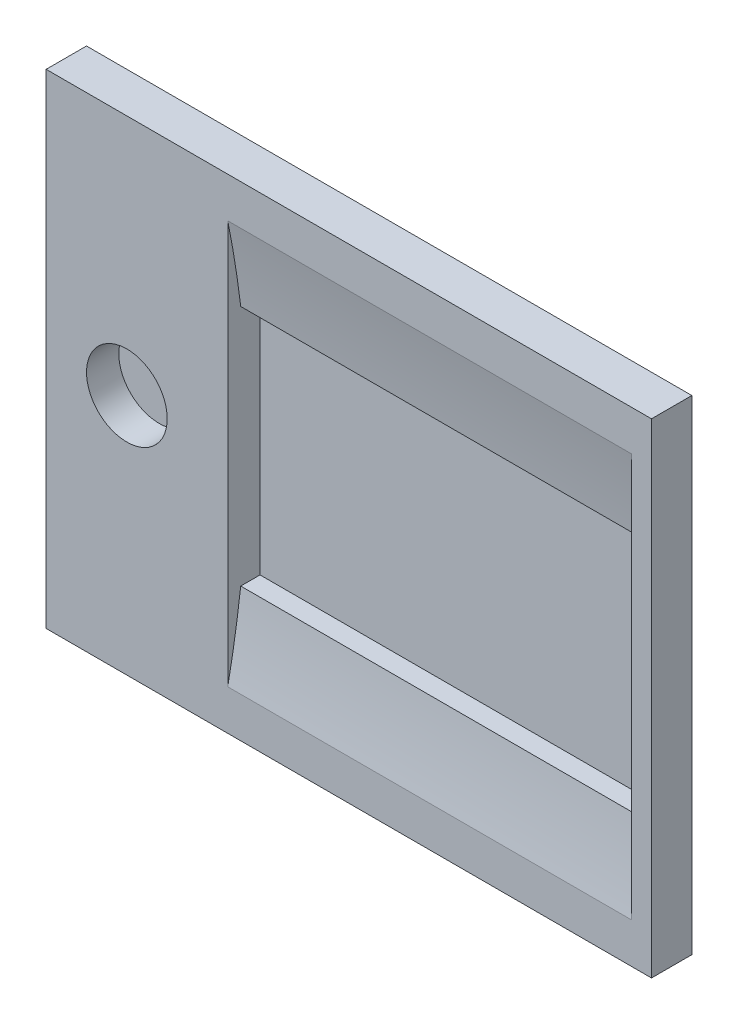
ISO-10303-21;
HEADER;
FILE_DESCRIPTION(('STEP AP214'),'2;1');
FILE_NAME('part.step','',(''),(''),'','','');
FILE_SCHEMA(('AUTOMOTIVE_DESIGN { 1 0 10303 214 1 1 1 1 }'));
ENDSEC;
DATA;
#1=APPLICATION_CONTEXT('core data for automotive mechanical design processes');
#2=APPLICATION_PROTOCOL_DEFINITION('international standard','automotive_design',2000,#1);
#3=PRODUCT_CONTEXT('',#1,'mechanical');
#4=PRODUCT('Part','Part','',(#3));
#5=PRODUCT_RELATED_PRODUCT_CATEGORY('part','',(#4));
#6=PRODUCT_DEFINITION_FORMATION('','',#4);
#7=PRODUCT_DEFINITION_CONTEXT('part definition',#1,'design');
#8=PRODUCT_DEFINITION('design','',#6,#7);
#9=PRODUCT_DEFINITION_SHAPE('','',#8);
#10=(LENGTH_UNIT() NAMED_UNIT(*) SI_UNIT(.MILLI.,.METRE.));
#11=(NAMED_UNIT(*) PLANE_ANGLE_UNIT() SI_UNIT($,.RADIAN.));
#12=(NAMED_UNIT(*) SI_UNIT($,.STERADIAN.) SOLID_ANGLE_UNIT());
#13=UNCERTAINTY_MEASURE_WITH_UNIT(LENGTH_MEASURE(1.E-05),#10,'distance_accuracy_value','');
#14=(GEOMETRIC_REPRESENTATION_CONTEXT(3) GLOBAL_UNCERTAINTY_ASSIGNED_CONTEXT((#13)) GLOBAL_UNIT_ASSIGNED_CONTEXT((#10,
#11,#12)) REPRESENTATION_CONTEXT('',''));
#15=CARTESIAN_POINT('',(0.,0.,0.));
#16=DIRECTION('',(0.,0.,1.));
#17=DIRECTION('',(1.,0.,0.));
#18=AXIS2_PLACEMENT_3D('',#15,#16,#17);
#19=CARTESIAN_POINT('',(0.,0.,1.5875));
#20=DIRECTION('',(0.,0.,-1.));
#21=DIRECTION('',(-1.,0.,0.));
#22=AXIS2_PLACEMENT_3D('',#19,#20,#21);
#23=PLANE('',#22);
#24=DIRECTION('',(0.,1.,0.));
#25=VECTOR('',#24,1.);
#26=CARTESIAN_POINT('',(23.8125,-19.05,1.5875));
#27=LINE('',#26,#25);
#28=CARTESIAN_POINT('',(23.8125,-19.05,1.5875));
#29=VERTEX_POINT('',#28);
#30=CARTESIAN_POINT('',(23.8125,19.05,1.5875));
#31=VERTEX_POINT('',#30);
#32=EDGE_CURVE('E179',#29,#31,#27,.T.);
#33=ORIENTED_EDGE('',*,*,#32,.T.);
#34=DIRECTION('',(-1.,0.,0.));
#35=VECTOR('',#34,1.);
#36=CARTESIAN_POINT('',(-23.8125,19.05,1.5875));
#37=LINE('',#36,#35);
#38=CARTESIAN_POINT('',(-23.8125,19.05,1.5875));
#39=VERTEX_POINT('',#38);
#40=EDGE_CURVE('E86',#31,#39,#37,.T.);
#41=ORIENTED_EDGE('',*,*,#40,.T.);
#42=DIRECTION('',(0.,-1.,0.));
#43=VECTOR('',#42,1.);
#44=CARTESIAN_POINT('',(-23.8125,-19.05,1.5875));
#45=LINE('',#44,#43);
#46=CARTESIAN_POINT('',(-23.8125,-19.05,1.5875));
#47=VERTEX_POINT('',#46);
#48=EDGE_CURVE('E182',#39,#47,#45,.T.);
#49=ORIENTED_EDGE('',*,*,#48,.T.);
#50=DIRECTION('',(1.,0.,0.));
#51=VECTOR('',#50,1.);
#52=CARTESIAN_POINT('',(-23.8125,-19.05,1.5875));
#53=LINE('',#52,#51);
#54=EDGE_CURVE('E58',#47,#29,#53,.T.);
#55=ORIENTED_EDGE('',*,*,#54,.T.);
#56=EDGE_LOOP('',(#33,#41,#49,#55));
#57=FACE_BOUND('',#56,.T.);
#58=CARTESIAN_POINT('',(-17.4625,0.,1.5875));
#59=DIRECTION('',(0.,0.,1.));
#60=DIRECTION('',(1.,0.,0.));
#61=AXIS2_PLACEMENT_3D('',#58,#59,#60);
#62=CIRCLE('',#61,3.175);
#63=CARTESIAN_POINT('',(-14.2875,0.,1.5875));
#64=VERTEX_POINT('',#63);
#65=EDGE_CURVE('E152',#64,#64,#62,.T.);
#66=ORIENTED_EDGE('',*,*,#65,.F.);
#67=EDGE_LOOP('',(#66));
#68=FACE_BOUND('',#67,.T.);
#69=DIRECTION('',(1.,0.,0.));
#70=VECTOR('',#69,1.);
#71=CARTESIAN_POINT('',(-41.3146627262701,15.875,1.5875));
#72=LINE('',#71,#70);
#73=CARTESIAN_POINT('',(-9.525,15.875,1.5875));
#74=VERTEX_POINT('',#73);
#75=CARTESIAN_POINT('',(22.225,15.875,1.5875));
#76=VERTEX_POINT('',#75);
#77=EDGE_CURVE('E138',#74,#76,#72,.T.);
#78=ORIENTED_EDGE('',*,*,#77,.T.);
#79=DIRECTION('',(0.,1.,0.));
#80=VECTOR('',#79,1.);
#81=CARTESIAN_POINT('',(22.225,0.,1.5875));
#82=LINE('',#81,#80);
#83=CARTESIAN_POINT('',(22.225,-15.8750000000001,1.5875));
#84=VERTEX_POINT('',#83);
#85=EDGE_CURVE('E120',#84,#76,#82,.T.);
#86=ORIENTED_EDGE('',*,*,#85,.F.);
#87=DIRECTION('',(1.,0.,0.));
#88=VECTOR('',#87,1.);
#89=CARTESIAN_POINT('',(-41.3146627262701,-15.8750000000001,1.5875));
#90=LINE('',#89,#88);
#91=CARTESIAN_POINT('',(-9.525,-15.8750000000001,1.5875));
#92=VERTEX_POINT('',#91);
#93=EDGE_CURVE('E143',#92,#84,#90,.T.);
#94=ORIENTED_EDGE('',*,*,#93,.F.);
#95=DIRECTION('',(0.,1.,0.));
#96=VECTOR('',#95,1.);
#97=CARTESIAN_POINT('',(-9.525,0.,1.5875));
#98=LINE('',#97,#96);
#99=EDGE_CURVE('E133',#92,#74,#98,.T.);
#100=ORIENTED_EDGE('',*,*,#99,.T.);
#101=EDGE_LOOP('',(#78,#86,#94,#100));
#102=FACE_BOUND('',#101,.T.);
#103=ADVANCED_FACE('F34',(#57,#68,#102),#23,.F.);
#104=CARTESIAN_POINT('',(23.8125,-19.05,1.5875));
#105=DIRECTION('',(-1.,0.,0.));
#106=DIRECTION('',(0.,0.,1.));
#107=AXIS2_PLACEMENT_3D('',#104,#105,#106);
#108=PLANE('',#107);
#109=DIRECTION('',(0.,1.,0.));
#110=VECTOR('',#109,1.);
#111=CARTESIAN_POINT('',(23.8125,-19.05,-1.5875));
#112=LINE('',#111,#110);
#113=CARTESIAN_POINT('',(23.8125,-19.05,-1.5875));
#114=VERTEX_POINT('',#113);
#115=CARTESIAN_POINT('',(23.8125,19.05,-1.5875));
#116=VERTEX_POINT('',#115);
#117=EDGE_CURVE('E167',#114,#116,#112,.T.);
#118=ORIENTED_EDGE('',*,*,#117,.T.);
#119=DIRECTION('',(0.,0.,-1.));
#120=VECTOR('',#119,1.);
#121=CARTESIAN_POINT('',(23.8125,19.05,1.5875));
#122=LINE('',#121,#120);
#123=EDGE_CURVE('E11',#31,#116,#122,.T.);
#124=ORIENTED_EDGE('',*,*,#123,.F.);
#125=ORIENTED_EDGE('',*,*,#32,.F.);
#126=DIRECTION('',(0.,0.,-1.));
#127=VECTOR('',#126,1.);
#128=CARTESIAN_POINT('',(23.8125,-19.05,1.5875));
#129=LINE('',#128,#127);
#130=EDGE_CURVE('E185',#29,#114,#129,.T.);
#131=ORIENTED_EDGE('',*,*,#130,.T.);
#132=EDGE_LOOP('',(#118,#124,#125,#131));
#133=FACE_BOUND('',#132,.T.);
#134=ADVANCED_FACE('F36',(#133),#108,.F.);
#135=CARTESIAN_POINT('',(-23.8125,19.05,1.5875));
#136=DIRECTION('',(0.,-1.,0.));
#137=DIRECTION('',(0.,0.,-1.));
#138=AXIS2_PLACEMENT_3D('',#135,#136,#137);
#139=PLANE('',#138);
#140=DIRECTION('',(-1.,0.,0.));
#141=VECTOR('',#140,1.);
#142=CARTESIAN_POINT('',(-23.8125,19.05,-1.5875));
#143=LINE('',#142,#141);
#144=CARTESIAN_POINT('',(-23.8125,19.05,-1.5875));
#145=VERTEX_POINT('',#144);
#146=EDGE_CURVE('E188',#116,#145,#143,.T.);
#147=ORIENTED_EDGE('',*,*,#146,.T.);
#148=DIRECTION('',(0.,0.,-1.));
#149=VECTOR('',#148,1.);
#150=CARTESIAN_POINT('',(-23.8125,19.05,1.5875));
#151=LINE('',#150,#149);
#152=EDGE_CURVE('E42',#39,#145,#151,.T.);
#153=ORIENTED_EDGE('',*,*,#152,.F.);
#154=ORIENTED_EDGE('',*,*,#40,.F.);
#155=ORIENTED_EDGE('',*,*,#123,.T.);
#156=EDGE_LOOP('',(#147,#153,#154,#155));
#157=FACE_BOUND('',#156,.T.);
#158=ADVANCED_FACE('F216',(#157),#139,.F.);
#159=CARTESIAN_POINT('',(-23.8125,-19.05,1.5875));
#160=DIRECTION('',(1.,0.,0.));
#161=DIRECTION('',(0.,0.,-1.));
#162=AXIS2_PLACEMENT_3D('',#159,#160,#161);
#163=PLANE('',#162);
#164=DIRECTION('',(0.,-1.,0.));
#165=VECTOR('',#164,1.);
#166=CARTESIAN_POINT('',(-23.8125,-19.05,-1.5875));
#167=LINE('',#166,#165);
#168=CARTESIAN_POINT('',(-23.8125,-19.05,-1.5875));
#169=VERTEX_POINT('',#168);
#170=EDGE_CURVE('E190',#145,#169,#167,.T.);
#171=ORIENTED_EDGE('',*,*,#170,.T.);
#172=DIRECTION('',(0.,0.,-1.));
#173=VECTOR('',#172,1.);
#174=CARTESIAN_POINT('',(-23.8125,-19.05,1.5875));
#175=LINE('',#174,#173);
#176=EDGE_CURVE('E194',#47,#169,#175,.T.);
#177=ORIENTED_EDGE('',*,*,#176,.F.);
#178=ORIENTED_EDGE('',*,*,#48,.F.);
#179=ORIENTED_EDGE('',*,*,#152,.T.);
#180=EDGE_LOOP('',(#171,#177,#178,#179));
#181=FACE_BOUND('',#180,.T.);
#182=ADVANCED_FACE('F199',(#181),#163,.F.);
#183=CARTESIAN_POINT('',(-23.8125,-19.05,1.5875));
#184=DIRECTION('',(0.,1.,0.));
#185=DIRECTION('',(0.,0.,1.));
#186=AXIS2_PLACEMENT_3D('',#183,#184,#185);
#187=PLANE('',#186);
#188=DIRECTION('',(1.,0.,0.));
#189=VECTOR('',#188,1.);
#190=CARTESIAN_POINT('',(-23.8125,-19.05,-1.5875));
#191=LINE('',#190,#189);
#192=EDGE_CURVE('E79',#169,#114,#191,.T.);
#193=ORIENTED_EDGE('',*,*,#192,.T.);
#194=ORIENTED_EDGE('',*,*,#130,.F.);
#195=ORIENTED_EDGE('',*,*,#54,.F.);
#196=ORIENTED_EDGE('',*,*,#176,.T.);
#197=EDGE_LOOP('',(#193,#194,#195,#196));
#198=FACE_BOUND('',#197,.T.);
#199=ADVANCED_FACE('F207',(#198),#187,.F.);
#200=CARTESIAN_POINT('',(0.,0.,-1.5875));
#201=DIRECTION('',(0.,0.,-1.));
#202=DIRECTION('',(-1.,0.,0.));
#203=AXIS2_PLACEMENT_3D('',#200,#201,#202);
#204=PLANE('',#203);
#205=ORIENTED_EDGE('',*,*,#117,.F.);
#206=ORIENTED_EDGE('',*,*,#192,.F.);
#207=ORIENTED_EDGE('',*,*,#170,.F.);
#208=ORIENTED_EDGE('',*,*,#146,.F.);
#209=EDGE_LOOP('',(#205,#206,#207,#208));
#210=FACE_BOUND('',#209,.T.);
#211=ADVANCED_FACE('F203',(#210),#204,.T.);
#212=CARTESIAN_POINT('',(-17.4625,0.,-0.9525));
#213=DIRECTION('',(0.,0.,1.));
#214=DIRECTION('',(1.,0.,0.));
#215=AXIS2_PLACEMENT_3D('',#212,#213,#214);
#216=CYLINDRICAL_SURFACE('',#215,3.175);
#217=CARTESIAN_POINT('',(-17.4625,0.,-0.9525));
#218=DIRECTION('',(0.,0.,1.));
#219=DIRECTION('',(1.,0.,0.));
#220=AXIS2_PLACEMENT_3D('',#217,#218,#219);
#221=CIRCLE('',#220,3.175);
#222=CARTESIAN_POINT('',(-14.2875,0.,-0.9525));
#223=VERTEX_POINT('',#222);
#224=EDGE_CURVE('E163',#223,#223,#221,.T.);
#225=ORIENTED_EDGE('',*,*,#224,.F.);
#226=EDGE_LOOP('',(#225));
#227=FACE_BOUND('',#226,.T.);
#228=ORIENTED_EDGE('',*,*,#65,.T.);
#229=EDGE_LOOP('',(#228));
#230=FACE_BOUND('',#229,.T.);
#231=ADVANCED_FACE('F214',(#227,#230),#216,.F.);
#232=CARTESIAN_POINT('',(0.,0.,-0.9525));
#233=DIRECTION('',(0.,0.,1.));
#234=DIRECTION('',(1.,0.,0.));
#235=AXIS2_PLACEMENT_3D('',#232,#233,#234);
#236=PLANE('',#235);
#237=ORIENTED_EDGE('',*,*,#224,.T.);
#238=EDGE_LOOP('',(#237));
#239=FACE_BOUND('',#238,.T.);
#240=ADVANCED_FACE('F227',(#239),#236,.T.);
#241=CARTESIAN_POINT('',(0.,9.525,-0.9525));
#242=DIRECTION('',(0.,-1.,0.));
#243=DIRECTION('',(0.,0.,-1.));
#244=AXIS2_PLACEMENT_3D('',#241,#242,#243);
#245=PLANE('',#244);
#246=DIRECTION('',(1.,0.,0.));
#247=VECTOR('',#246,1.);
#248=CARTESIAN_POINT('',(-41.3146627262701,9.525,0.567852696247831));
#249=LINE('',#248,#247);
#250=CARTESIAN_POINT('',(-9.525,9.525,0.567852696247831));
#251=VERTEX_POINT('',#250);
#252=CARTESIAN_POINT('',(22.225,9.525,0.567852696247831));
#253=VERTEX_POINT('',#252);
#254=EDGE_CURVE('E140',#251,#253,#249,.T.);
#255=ORIENTED_EDGE('',*,*,#254,.F.);
#256=DIRECTION('',(0.,0.,1.));
#257=VECTOR('',#256,1.);
#258=CARTESIAN_POINT('',(-9.525,9.525,-0.9525));
#259=LINE('',#258,#257);
#260=CARTESIAN_POINT('',(-9.525,9.525,-0.9525));
#261=VERTEX_POINT('',#260);
#262=EDGE_CURVE('E162',#261,#251,#259,.T.);
#263=ORIENTED_EDGE('',*,*,#262,.F.);
#264=DIRECTION('',(1.,0.,0.));
#265=VECTOR('',#264,1.);
#266=CARTESIAN_POINT('',(0.,9.525,-0.9525));
#267=LINE('',#266,#265);
#268=CARTESIAN_POINT('',(22.225,9.525,-0.9525));
#269=VERTEX_POINT('',#268);
#270=EDGE_CURVE('E132',#261,#269,#267,.T.);
#271=ORIENTED_EDGE('',*,*,#270,.T.);
#272=DIRECTION('',(0.,0.,1.));
#273=VECTOR('',#272,1.);
#274=CARTESIAN_POINT('',(22.225,9.525,-0.9525));
#275=LINE('',#274,#273);
#276=EDGE_CURVE('E165',#269,#253,#275,.T.);
#277=ORIENTED_EDGE('',*,*,#276,.T.);
#278=EDGE_LOOP('',(#255,#263,#271,#277));
#279=FACE_BOUND('',#278,.T.);
#280=ADVANCED_FACE('F231',(#279),#245,.T.);
#281=CARTESIAN_POINT('',(22.225,0.,-0.9525));
#282=DIRECTION('',(1.,0.,0.));
#283=DIRECTION('',(0.,0.,-1.));
#284=AXIS2_PLACEMENT_3D('',#281,#282,#283);
#285=PLANE('',#284);
#286=DIRECTION('',(0.,0.,1.));
#287=VECTOR('',#286,1.);
#288=CARTESIAN_POINT('',(22.225,-9.525,-0.9525));
#289=LINE('',#288,#287);
#290=CARTESIAN_POINT('',(22.225,-9.525,-0.9525));
#291=VERTEX_POINT('',#290);
#292=CARTESIAN_POINT('',(22.225,-9.525,0.567852696247831));
#293=VERTEX_POINT('',#292);
#294=EDGE_CURVE('E168',#291,#293,#289,.T.);
#295=ORIENTED_EDGE('',*,*,#294,.T.);
#296=CARTESIAN_POINT('',(22.225,0.,80.16875));
#297=DIRECTION('',(1.,0.,0.));
#298=DIRECTION('',(0.,0.,-1.));
#299=AXIS2_PLACEMENT_3D('',#296,#297,#298);
#300=CIRCLE('',#299,80.16875);
#301=EDGE_CURVE('E127',#84,#293,#300,.T.);
#302=ORIENTED_EDGE('',*,*,#301,.F.);
#303=ORIENTED_EDGE('',*,*,#85,.T.);
#304=EDGE_CURVE('E125',#253,#76,#300,.T.);
#305=ORIENTED_EDGE('',*,*,#304,.F.);
#306=ORIENTED_EDGE('',*,*,#276,.F.);
#307=DIRECTION('',(0.,1.,0.));
#308=VECTOR('',#307,1.);
#309=CARTESIAN_POINT('',(22.225,0.,-0.9525));
#310=LINE('',#309,#308);
#311=EDGE_CURVE('E159',#291,#269,#310,.T.);
#312=ORIENTED_EDGE('',*,*,#311,.F.);
#313=EDGE_LOOP('',(#295,#302,#303,#305,#306,#312));
#314=FACE_BOUND('',#313,.T.);
#315=ADVANCED_FACE('F123',(#314),#285,.F.);
#316=CARTESIAN_POINT('',(0.,-9.525,-0.9525));
#317=DIRECTION('',(0.,-1.,0.));
#318=DIRECTION('',(0.,0.,-1.));
#319=AXIS2_PLACEMENT_3D('',#316,#317,#318);
#320=PLANE('',#319);
#321=DIRECTION('',(0.,0.,1.));
#322=VECTOR('',#321,1.);
#323=CARTESIAN_POINT('',(-9.525,-9.525,-0.9525));
#324=LINE('',#323,#322);
#325=CARTESIAN_POINT('',(-9.525,-9.525,-0.9525));
#326=VERTEX_POINT('',#325);
#327=CARTESIAN_POINT('',(-9.525,-9.525,0.567852696247831));
#328=VERTEX_POINT('',#327);
#329=EDGE_CURVE('E170',#326,#328,#324,.T.);
#330=ORIENTED_EDGE('',*,*,#329,.T.);
#331=DIRECTION('',(1.,0.,0.));
#332=VECTOR('',#331,1.);
#333=CARTESIAN_POINT('',(-41.3146627262701,-9.525,0.567852696247831));
#334=LINE('',#333,#332);
#335=EDGE_CURVE('E147',#328,#293,#334,.T.);
#336=ORIENTED_EDGE('',*,*,#335,.T.);
#337=ORIENTED_EDGE('',*,*,#294,.F.);
#338=DIRECTION('',(1.,0.,0.));
#339=VECTOR('',#338,1.);
#340=CARTESIAN_POINT('',(0.,-9.525,-0.9525));
#341=LINE('',#340,#339);
#342=EDGE_CURVE('E156',#326,#291,#341,.T.);
#343=ORIENTED_EDGE('',*,*,#342,.F.);
#344=EDGE_LOOP('',(#330,#336,#337,#343));
#345=FACE_BOUND('',#344,.T.);
#346=ADVANCED_FACE('F240',(#345),#320,.F.);
#347=CARTESIAN_POINT('',(-9.525,0.,-0.9525));
#348=DIRECTION('',(1.,0.,0.));
#349=DIRECTION('',(0.,0.,-1.));
#350=AXIS2_PLACEMENT_3D('',#347,#348,#349);
#351=PLANE('',#350);
#352=ORIENTED_EDGE('',*,*,#262,.T.);
#353=CARTESIAN_POINT('',(-9.525,0.,80.16875));
#354=DIRECTION('',(1.,0.,0.));
#355=DIRECTION('',(0.,0.,-1.));
#356=AXIS2_PLACEMENT_3D('',#353,#354,#355);
#357=CIRCLE('',#356,80.16875);
#358=EDGE_CURVE('E150',#74,#251,#357,.F.);
#359=ORIENTED_EDGE('',*,*,#358,.F.);
#360=ORIENTED_EDGE('',*,*,#99,.F.);
#361=EDGE_CURVE('E49',#328,#92,#357,.F.);
#362=ORIENTED_EDGE('',*,*,#361,.F.);
#363=ORIENTED_EDGE('',*,*,#329,.F.);
#364=DIRECTION('',(0.,1.,0.));
#365=VECTOR('',#364,1.);
#366=CARTESIAN_POINT('',(-9.525,0.,-0.9525));
#367=LINE('',#366,#365);
#368=EDGE_CURVE('E154',#326,#261,#367,.T.);
#369=ORIENTED_EDGE('',*,*,#368,.T.);
#370=EDGE_LOOP('',(#352,#359,#360,#362,#363,#369));
#371=FACE_BOUND('',#370,.T.);
#372=ADVANCED_FACE('F236',(#371),#351,.T.);
#373=CARTESIAN_POINT('',(0.,0.,-0.9525));
#374=DIRECTION('',(0.,0.,1.));
#375=DIRECTION('',(1.,0.,0.));
#376=AXIS2_PLACEMENT_3D('',#373,#374,#375);
#377=PLANE('',#376);
#378=ORIENTED_EDGE('',*,*,#270,.F.);
#379=ORIENTED_EDGE('',*,*,#368,.F.);
#380=ORIENTED_EDGE('',*,*,#342,.T.);
#381=ORIENTED_EDGE('',*,*,#311,.T.);
#382=EDGE_LOOP('',(#378,#379,#380,#381));
#383=FACE_BOUND('',#382,.T.);
#384=ADVANCED_FACE('F239',(#383),#377,.T.);
#385=CARTESIAN_POINT('',(-41.3146627262701,0.,80.16875));
#386=DIRECTION('',(1.,0.,0.));
#387=DIRECTION('',(0.,0.,-1.));
#388=AXIS2_PLACEMENT_3D('',#385,#386,#387);
#389=CYLINDRICAL_SURFACE('',#388,80.16875);
#390=ORIENTED_EDGE('',*,*,#361,.T.);
#391=ORIENTED_EDGE('',*,*,#93,.T.);
#392=ORIENTED_EDGE('',*,*,#301,.T.);
#393=ORIENTED_EDGE('',*,*,#335,.F.);
#394=EDGE_LOOP('',(#390,#391,#392,#393));
#395=FACE_BOUND('',#394,.T.);
#396=ADVANCED_FACE('F248',(#395),#389,.F.);
#397=ORIENTED_EDGE('',*,*,#254,.T.);
#398=ORIENTED_EDGE('',*,*,#304,.T.);
#399=ORIENTED_EDGE('',*,*,#77,.F.);
#400=ORIENTED_EDGE('',*,*,#358,.T.);
#401=EDGE_LOOP('',(#397,#398,#399,#400));
#402=FACE_BOUND('',#401,.T.);
#403=ADVANCED_FACE('F137',(#402),#389,.F.);
#404=CLOSED_SHELL('',(#103,#134,#158,#182,#199,#211,#231,#240,#280,#315,#346,#372,#384,#396,#403));
#405=MANIFOLD_SOLID_BREP('B2',#404);
#406=ADVANCED_BREP_SHAPE_REPRESENTATION('',(#18,#405),#14);
#407=SHAPE_DEFINITION_REPRESENTATION(#9,#406);
ENDSEC;
END-ISO-10303-21;
